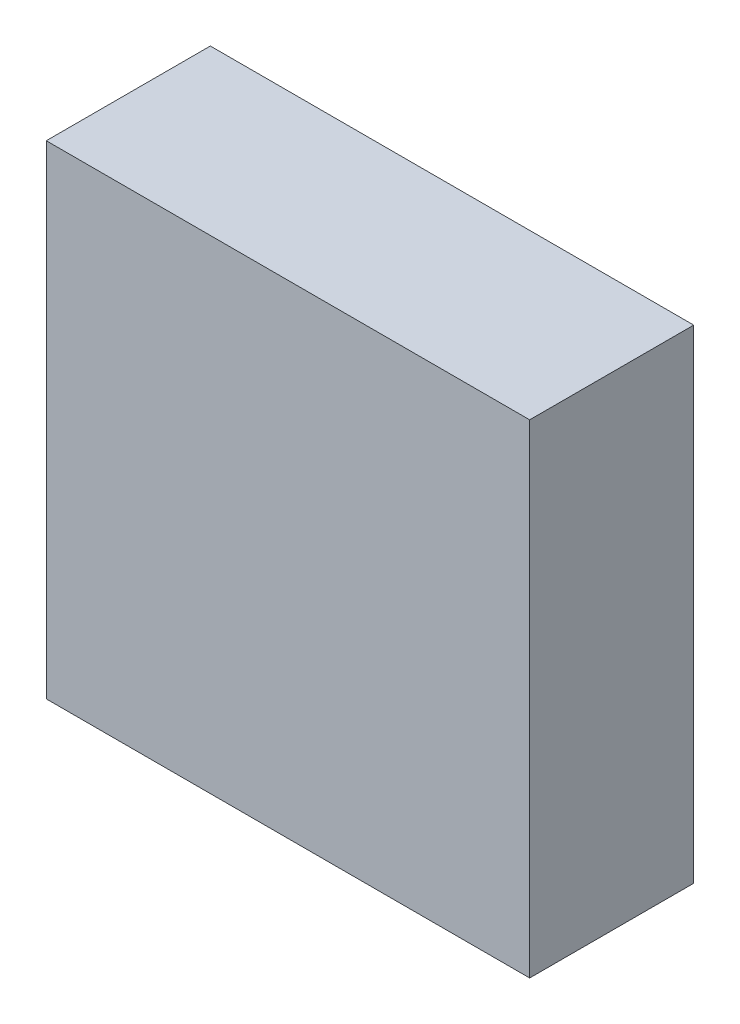
ISO-10303-21;
HEADER;
FILE_DESCRIPTION(('STEP AP214'),'2;1');
FILE_NAME('part.step','',(''),(''),'','','');
FILE_SCHEMA(('AUTOMOTIVE_DESIGN { 1 0 10303 214 1 1 1 1 }'));
ENDSEC;
DATA;
#1=APPLICATION_CONTEXT('core data for automotive mechanical design processes');
#2=APPLICATION_PROTOCOL_DEFINITION('international standard','automotive_design',2000,#1);
#3=PRODUCT_CONTEXT('',#1,'mechanical');
#4=PRODUCT('Part','Part','',(#3));
#5=PRODUCT_RELATED_PRODUCT_CATEGORY('part','',(#4));
#6=PRODUCT_DEFINITION_FORMATION('','',#4);
#7=PRODUCT_DEFINITION_CONTEXT('part definition',#1,'design');
#8=PRODUCT_DEFINITION('design','',#6,#7);
#9=PRODUCT_DEFINITION_SHAPE('','',#8);
#10=(LENGTH_UNIT() NAMED_UNIT(*) SI_UNIT(.MILLI.,.METRE.));
#11=(NAMED_UNIT(*) PLANE_ANGLE_UNIT() SI_UNIT($,.RADIAN.));
#12=(NAMED_UNIT(*) SI_UNIT($,.STERADIAN.) SOLID_ANGLE_UNIT());
#13=UNCERTAINTY_MEASURE_WITH_UNIT(LENGTH_MEASURE(1.E-05),#10,'distance_accuracy_value','');
#14=(GEOMETRIC_REPRESENTATION_CONTEXT(3) GLOBAL_UNCERTAINTY_ASSIGNED_CONTEXT((#13)) GLOBAL_UNIT_ASSIGNED_CONTEXT((#10,
#11,#12)) REPRESENTATION_CONTEXT('',''));
#15=CARTESIAN_POINT('',(0.,0.,0.));
#16=DIRECTION('',(0.,0.,1.));
#17=DIRECTION('',(1.,0.,0.));
#18=AXIS2_PLACEMENT_3D('',#15,#16,#17);
#19=CARTESIAN_POINT('',(-1.64999924,-1.64999924,1.1200003));
#20=DIRECTION('',(0.,0.,-1.));
#21=DIRECTION('',(-1.,0.,0.));
#22=AXIS2_PLACEMENT_3D('',#19,#20,#21);
#23=PLANE('',#22);
#24=DIRECTION('',(0.,1.,0.));
#25=VECTOR('',#24,1.);
#26=CARTESIAN_POINT('',(1.64999924,-1.64999924,1.1200003));
#27=LINE('',#26,#25);
#28=CARTESIAN_POINT('',(1.64999924,-1.64999924,1.1200003));
#29=VERTEX_POINT('',#28);
#30=CARTESIAN_POINT('',(1.64999924,1.64999924,1.1200003));
#31=VERTEX_POINT('',#30);
#32=EDGE_CURVE('E55',#29,#31,#27,.T.);
#33=ORIENTED_EDGE('',*,*,#32,.T.);
#34=DIRECTION('',(1.,0.,0.));
#35=VECTOR('',#34,1.);
#36=CARTESIAN_POINT('',(1.64999924,1.64999924,1.1200003));
#37=LINE('',#36,#35);
#38=CARTESIAN_POINT('',(-1.64999924,1.64999924,1.1200003));
#39=VERTEX_POINT('',#38);
#40=EDGE_CURVE('E57',#31,#39,#37,.F.);
#41=ORIENTED_EDGE('',*,*,#40,.T.);
#42=DIRECTION('',(0.,1.,0.));
#43=VECTOR('',#42,1.);
#44=CARTESIAN_POINT('',(-1.64999924,1.64999924,1.1200003));
#45=LINE('',#44,#43);
#46=CARTESIAN_POINT('',(-1.64999924,-1.64999924,1.1200003));
#47=VERTEX_POINT('',#46);
#48=EDGE_CURVE('E20',#39,#47,#45,.F.);
#49=ORIENTED_EDGE('',*,*,#48,.T.);
#50=DIRECTION('',(1.,0.,0.));
#51=VECTOR('',#50,1.);
#52=CARTESIAN_POINT('',(-1.64999924,-1.64999924,1.1200003));
#53=LINE('',#52,#51);
#54=EDGE_CURVE('E80',#47,#29,#53,.T.);
#55=ORIENTED_EDGE('',*,*,#54,.T.);
#56=EDGE_LOOP('',(#33,#41,#49,#55));
#57=FACE_BOUND('',#56,.T.);
#58=ADVANCED_FACE('F17',(#57),#23,.F.);
#59=CARTESIAN_POINT('',(-1.64999924,1.64999924,0.));
#60=DIRECTION('',(1.,0.,0.));
#61=DIRECTION('',(0.,0.,-1.));
#62=AXIS2_PLACEMENT_3D('',#59,#60,#61);
#63=PLANE('',#62);
#64=DIRECTION('',(0.,0.,1.));
#65=VECTOR('',#64,1.);
#66=CARTESIAN_POINT('',(-1.64999924,-1.64999924,0.));
#67=LINE('',#66,#65);
#68=CARTESIAN_POINT('',(-1.64999924,-1.64999924,0.));
#69=VERTEX_POINT('',#68);
#70=EDGE_CURVE('E68',#69,#47,#67,.T.);
#71=ORIENTED_EDGE('',*,*,#70,.T.);
#72=ORIENTED_EDGE('',*,*,#48,.F.);
#73=DIRECTION('',(0.,0.,-1.));
#74=VECTOR('',#73,1.);
#75=CARTESIAN_POINT('',(-1.64999924,1.64999924,0.));
#76=LINE('',#75,#74);
#77=CARTESIAN_POINT('',(-1.64999924,1.64999924,0.));
#78=VERTEX_POINT('',#77);
#79=EDGE_CURVE('E63',#39,#78,#76,.T.);
#80=ORIENTED_EDGE('',*,*,#79,.T.);
#81=DIRECTION('',(0.,1.,0.));
#82=VECTOR('',#81,1.);
#83=CARTESIAN_POINT('',(-1.64999924,-1.64999924,0.));
#84=LINE('',#83,#82);
#85=EDGE_CURVE('E83',#69,#78,#84,.T.);
#86=ORIENTED_EDGE('',*,*,#85,.F.);
#87=EDGE_LOOP('',(#71,#72,#80,#86));
#88=FACE_BOUND('',#87,.T.);
#89=ADVANCED_FACE('F65',(#88),#63,.F.);
#90=CARTESIAN_POINT('',(1.64999924,1.64999924,0.));
#91=DIRECTION('',(0.,-1.,0.));
#92=DIRECTION('',(0.,0.,-1.));
#93=AXIS2_PLACEMENT_3D('',#90,#91,#92);
#94=PLANE('',#93);
#95=ORIENTED_EDGE('',*,*,#79,.F.);
#96=ORIENTED_EDGE('',*,*,#40,.F.);
#97=DIRECTION('',(0.,0.,1.));
#98=VECTOR('',#97,1.);
#99=CARTESIAN_POINT('',(1.64999924,1.64999924,0.));
#100=LINE('',#99,#98);
#101=CARTESIAN_POINT('',(1.64999924,1.64999924,0.));
#102=VERTEX_POINT('',#101);
#103=EDGE_CURVE('E75',#31,#102,#100,.F.);
#104=ORIENTED_EDGE('',*,*,#103,.T.);
#105=DIRECTION('',(-1.,0.,0.));
#106=VECTOR('',#105,1.);
#107=CARTESIAN_POINT('',(-1.64999924,1.64999924,0.));
#108=LINE('',#107,#106);
#109=EDGE_CURVE('E72',#78,#102,#108,.F.);
#110=ORIENTED_EDGE('',*,*,#109,.F.);
#111=EDGE_LOOP('',(#95,#96,#104,#110));
#112=FACE_BOUND('',#111,.T.);
#113=ADVANCED_FACE('F70',(#112),#94,.F.);
#114=CARTESIAN_POINT('',(1.64999924,-1.64999924,0.));
#115=DIRECTION('',(-1.,0.,0.));
#116=DIRECTION('',(0.,0.,1.));
#117=AXIS2_PLACEMENT_3D('',#114,#115,#116);
#118=PLANE('',#117);
#119=ORIENTED_EDGE('',*,*,#103,.F.);
#120=ORIENTED_EDGE('',*,*,#32,.F.);
#121=DIRECTION('',(0.,0.,1.));
#122=VECTOR('',#121,1.);
#123=CARTESIAN_POINT('',(1.64999924,-1.64999924,0.));
#124=LINE('',#123,#122);
#125=CARTESIAN_POINT('',(1.64999924,-1.64999924,0.));
#126=VERTEX_POINT('',#125);
#127=EDGE_CURVE('E35',#29,#126,#124,.F.);
#128=ORIENTED_EDGE('',*,*,#127,.T.);
#129=DIRECTION('',(0.,1.,0.));
#130=VECTOR('',#129,1.);
#131=CARTESIAN_POINT('',(1.64999924,-1.64999924,0.));
#132=LINE('',#131,#130);
#133=EDGE_CURVE('E26',#102,#126,#132,.F.);
#134=ORIENTED_EDGE('',*,*,#133,.F.);
#135=EDGE_LOOP('',(#119,#120,#128,#134));
#136=FACE_BOUND('',#135,.T.);
#137=ADVANCED_FACE('F89',(#136),#118,.F.);
#138=CARTESIAN_POINT('',(-1.64999924,-1.64999924,0.));
#139=DIRECTION('',(0.,1.,0.));
#140=DIRECTION('',(0.,0.,1.));
#141=AXIS2_PLACEMENT_3D('',#138,#139,#140);
#142=PLANE('',#141);
#143=ORIENTED_EDGE('',*,*,#127,.F.);
#144=ORIENTED_EDGE('',*,*,#54,.F.);
#145=ORIENTED_EDGE('',*,*,#70,.F.);
#146=DIRECTION('',(-1.,0.,0.));
#147=VECTOR('',#146,1.);
#148=CARTESIAN_POINT('',(-1.64999924,-1.64999924,0.));
#149=LINE('',#148,#147);
#150=EDGE_CURVE('E11',#126,#69,#149,.T.);
#151=ORIENTED_EDGE('',*,*,#150,.F.);
#152=EDGE_LOOP('',(#143,#144,#145,#151));
#153=FACE_BOUND('',#152,.T.);
#154=ADVANCED_FACE('F91',(#153),#142,.F.);
#155=CARTESIAN_POINT('',(-1.64999924,-1.64999924,0.));
#156=DIRECTION('',(0.,0.,-1.));
#157=DIRECTION('',(-1.,0.,0.));
#158=AXIS2_PLACEMENT_3D('',#155,#156,#157);
#159=PLANE('',#158);
#160=ORIENTED_EDGE('',*,*,#133,.T.);
#161=ORIENTED_EDGE('',*,*,#150,.T.);
#162=ORIENTED_EDGE('',*,*,#85,.T.);
#163=ORIENTED_EDGE('',*,*,#109,.T.);
#164=EDGE_LOOP('',(#160,#161,#162,#163));
#165=FACE_BOUND('',#164,.T.);
#166=ADVANCED_FACE('F88',(#165),#159,.T.);
#167=CLOSED_SHELL('',(#58,#89,#113,#137,#154,#166));
#168=MANIFOLD_SOLID_BREP('B1',#167);
#169=ADVANCED_BREP_SHAPE_REPRESENTATION('',(#18,#168),#14);
#170=SHAPE_DEFINITION_REPRESENTATION(#9,#169);
ENDSEC;
END-ISO-10303-21;
